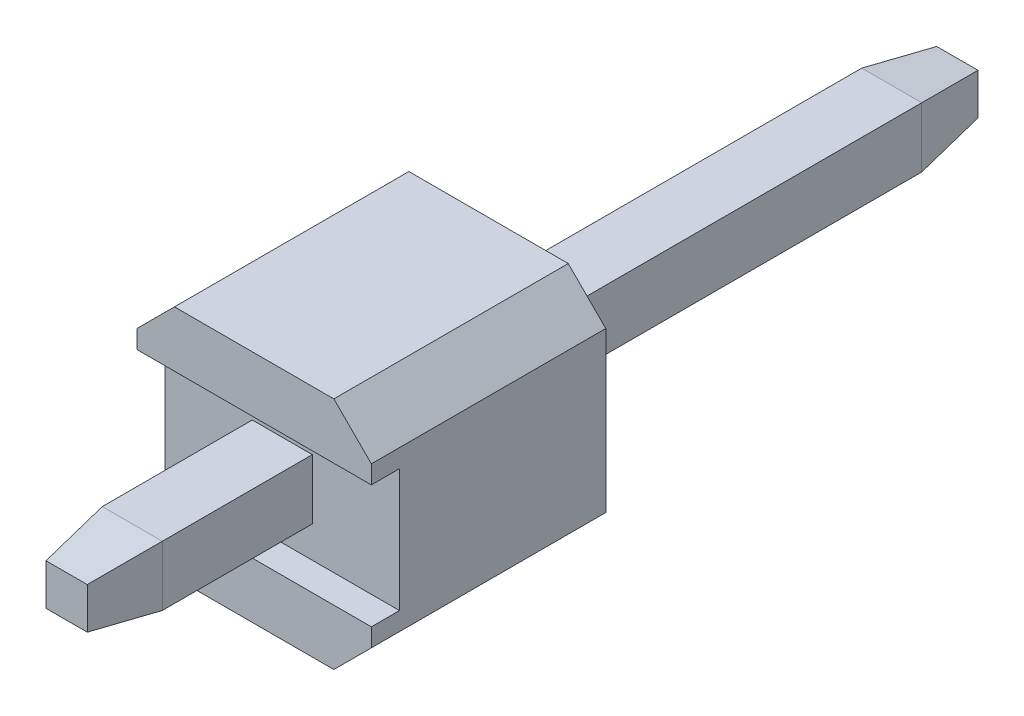
ISO-10303-21;
HEADER;
FILE_DESCRIPTION(('STEP AP214'),'2;1');
FILE_NAME('part.step','',(''),(''),'','','');
FILE_SCHEMA(('AUTOMOTIVE_DESIGN { 1 0 10303 214 1 1 1 1 }'));
ENDSEC;
DATA;
#1=APPLICATION_CONTEXT('core data for automotive mechanical design processes');
#2=APPLICATION_PROTOCOL_DEFINITION('international standard','automotive_design',2000,#1);
#3=PRODUCT_CONTEXT('',#1,'mechanical');
#4=PRODUCT('Part','Part','',(#3));
#5=PRODUCT_RELATED_PRODUCT_CATEGORY('part','',(#4));
#6=PRODUCT_DEFINITION_FORMATION('','',#4);
#7=PRODUCT_DEFINITION_CONTEXT('part definition',#1,'design');
#8=PRODUCT_DEFINITION('design','',#6,#7);
#9=PRODUCT_DEFINITION_SHAPE('','',#8);
#10=(LENGTH_UNIT() NAMED_UNIT(*) SI_UNIT(.MILLI.,.METRE.));
#11=(NAMED_UNIT(*) PLANE_ANGLE_UNIT() SI_UNIT($,.RADIAN.));
#12=(NAMED_UNIT(*) SI_UNIT($,.STERADIAN.) SOLID_ANGLE_UNIT());
#13=UNCERTAINTY_MEASURE_WITH_UNIT(LENGTH_MEASURE(1.E-05),#10,'distance_accuracy_value','');
#14=(GEOMETRIC_REPRESENTATION_CONTEXT(3) GLOBAL_UNCERTAINTY_ASSIGNED_CONTEXT((#13)) GLOBAL_UNIT_ASSIGNED_CONTEXT((#10,
#11,#12)) REPRESENTATION_CONTEXT('',''));
#15=CARTESIAN_POINT('',(0.,0.,0.));
#16=DIRECTION('',(0.,0.,1.));
#17=DIRECTION('',(1.,0.,0.));
#18=AXIS2_PLACEMENT_3D('',#15,#16,#17);
#19=CARTESIAN_POINT('',(-0.16,-0.27,-4.65));
#20=DIRECTION('',(0.,-0.989949493661167,-0.14142135623731));
#21=DIRECTION('',(0.,0.14142135623731,-0.989949493661167));
#22=AXIS2_PLACEMENT_3D('',#19,#20,#21);
#23=PLANE('',#22);
#24=DIRECTION('',(1.,0.,0.));
#25=VECTOR('',#24,1.);
#26=CARTESIAN_POINT('',(-0.16,-0.22,-5.));
#27=LINE('',#26,#25);
#28=CARTESIAN_POINT('',(-0.22,-0.22,-5.));
#29=VERTEX_POINT('',#28);
#30=CARTESIAN_POINT('',(0.22,-0.22,-5.));
#31=VERTEX_POINT('',#30);
#32=EDGE_CURVE('P0_E11',#29,#31,#27,.T.);
#33=ORIENTED_EDGE('',*,*,#32,.T.);
#34=DIRECTION('',(0.140028008402801,-0.140028008402801,0.980196058819607));
#35=VECTOR('',#34,1.);
#36=CARTESIAN_POINT('',(0.22,-0.22,-5.));
#37=LINE('',#36,#35);
#38=CARTESIAN_POINT('',(0.32,-0.32,-4.3));
#39=VERTEX_POINT('',#38);
#40=EDGE_CURVE('P0_E28',#31,#39,#37,.T.);
#41=ORIENTED_EDGE('',*,*,#40,.T.);
#42=DIRECTION('',(-1.,0.,0.));
#43=VECTOR('',#42,1.);
#44=CARTESIAN_POINT('',(-0.16,-0.32,-4.3));
#45=LINE('',#44,#43);
#46=CARTESIAN_POINT('',(-0.32,-0.32,-4.3));
#47=VERTEX_POINT('',#46);
#48=EDGE_CURVE('P0_E104',#39,#47,#45,.T.);
#49=ORIENTED_EDGE('',*,*,#48,.T.);
#50=DIRECTION('',(-0.140028008402801,-0.140028008402801,0.980196058819607));
#51=VECTOR('',#50,1.);
#52=CARTESIAN_POINT('',(-0.22,-0.22,-5.));
#53=LINE('',#52,#51);
#54=EDGE_CURVE('P0_E76',#29,#47,#53,.T.);
#55=ORIENTED_EDGE('',*,*,#54,.F.);
#56=EDGE_LOOP('',(#33,#41,#49,#55));
#57=FACE_BOUND('',#56,.T.);
#58=ADVANCED_FACE('P0_F17',(#57),#23,.T.);
#59=CARTESIAN_POINT('',(0.27,-0.16,-4.65));
#60=DIRECTION('',(0.989949493661167,0.,-0.14142135623731));
#61=DIRECTION('',(0.,-1.,0.));
#62=AXIS2_PLACEMENT_3D('',#59,#60,#61);
#63=PLANE('',#62);
#64=DIRECTION('',(0.,1.,0.));
#65=VECTOR('',#64,1.);
#66=CARTESIAN_POINT('',(0.22,-0.16,-5.));
#67=LINE('',#66,#65);
#68=CARTESIAN_POINT('',(0.22,0.22,-5.));
#69=VERTEX_POINT('',#68);
#70=EDGE_CURVE('P0_E109',#31,#69,#67,.T.);
#71=ORIENTED_EDGE('',*,*,#70,.T.);
#72=DIRECTION('',(0.140028008402801,0.140028008402801,0.980196058819607));
#73=VECTOR('',#72,1.);
#74=CARTESIAN_POINT('',(0.22,0.22,-5.));
#75=LINE('',#74,#73);
#76=CARTESIAN_POINT('',(0.32,0.32,-4.3));
#77=VERTEX_POINT('',#76);
#78=EDGE_CURVE('P0_E21',#69,#77,#75,.T.);
#79=ORIENTED_EDGE('',*,*,#78,.T.);
#80=DIRECTION('',(0.,-1.,0.));
#81=VECTOR('',#80,1.);
#82=CARTESIAN_POINT('',(0.32,-0.16,-4.3));
#83=LINE('',#82,#81);
#84=EDGE_CURVE('P0_E151',#77,#39,#83,.T.);
#85=ORIENTED_EDGE('',*,*,#84,.T.);
#86=ORIENTED_EDGE('',*,*,#40,.F.);
#87=EDGE_LOOP('',(#71,#79,#85,#86));
#88=FACE_BOUND('',#87,.T.);
#89=ADVANCED_FACE('P0_F174',(#88),#63,.T.);
#90=CARTESIAN_POINT('',(0.16,0.27,-4.65));
#91=DIRECTION('',(0.,0.989949493661167,-0.14142135623731));
#92=DIRECTION('',(-1.,0.,0.));
#93=AXIS2_PLACEMENT_3D('',#90,#91,#92);
#94=PLANE('',#93);
#95=DIRECTION('',(-1.,0.,0.));
#96=VECTOR('',#95,1.);
#97=CARTESIAN_POINT('',(0.16,0.22,-5.));
#98=LINE('',#97,#96);
#99=CARTESIAN_POINT('',(-0.22,0.22,-5.));
#100=VERTEX_POINT('',#99);
#101=EDGE_CURVE('P0_E147',#69,#100,#98,.T.);
#102=ORIENTED_EDGE('',*,*,#101,.T.);
#103=DIRECTION('',(-0.140028008402801,0.140028008402801,0.980196058819607));
#104=VECTOR('',#103,1.);
#105=CARTESIAN_POINT('',(-0.22,0.22,-5.));
#106=LINE('',#105,#104);
#107=CARTESIAN_POINT('',(-0.32,0.32,-4.3));
#108=VERTEX_POINT('',#107);
#109=EDGE_CURVE('P0_E152',#100,#108,#106,.T.);
#110=ORIENTED_EDGE('',*,*,#109,.T.);
#111=DIRECTION('',(1.,0.,0.));
#112=VECTOR('',#111,1.);
#113=CARTESIAN_POINT('',(0.16,0.32,-4.3));
#114=LINE('',#113,#112);
#115=EDGE_CURVE('P0_E101',#108,#77,#114,.T.);
#116=ORIENTED_EDGE('',*,*,#115,.T.);
#117=ORIENTED_EDGE('',*,*,#78,.F.);
#118=EDGE_LOOP('',(#102,#110,#116,#117));
#119=FACE_BOUND('',#118,.T.);
#120=ADVANCED_FACE('P0_F167',(#119),#94,.T.);
#121=CARTESIAN_POINT('',(-0.27,0.16,-4.65));
#122=DIRECTION('',(-0.989949493661167,0.,-0.14142135623731));
#123=DIRECTION('',(-0.14142135623731,0.,0.989949493661167));
#124=AXIS2_PLACEMENT_3D('',#121,#122,#123);
#125=PLANE('',#124);
#126=DIRECTION('',(0.,1.,0.));
#127=VECTOR('',#126,1.);
#128=CARTESIAN_POINT('',(-0.32,0.16,-4.3));
#129=LINE('',#128,#127);
#130=EDGE_CURVE('P0_E86',#47,#108,#129,.T.);
#131=ORIENTED_EDGE('',*,*,#130,.T.);
#132=ORIENTED_EDGE('',*,*,#109,.F.);
#133=DIRECTION('',(0.,-1.,0.));
#134=VECTOR('',#133,1.);
#135=CARTESIAN_POINT('',(-0.22,0.16,-5.));
#136=LINE('',#135,#134);
#137=EDGE_CURVE('P0_E89',#100,#29,#136,.T.);
#138=ORIENTED_EDGE('',*,*,#137,.T.);
#139=ORIENTED_EDGE('',*,*,#54,.T.);
#140=EDGE_LOOP('',(#131,#132,#138,#139));
#141=FACE_BOUND('',#140,.T.);
#142=ADVANCED_FACE('P0_F84',(#141),#125,.T.);
#143=CARTESIAN_POINT('',(-0.32,0.32,0.));
#144=DIRECTION('',(-1.,0.,0.));
#145=DIRECTION('',(0.,0.,1.));
#146=AXIS2_PLACEMENT_3D('',#143,#144,#145);
#147=PLANE('',#146);
#148=ORIENTED_EDGE('',*,*,#130,.F.);
#149=DIRECTION('',(0.,0.,1.));
#150=VECTOR('',#149,1.);
#151=CARTESIAN_POINT('',(-0.32,-0.32,0.));
#152=LINE('',#151,#150);
#153=CARTESIAN_POINT('',(-0.32,-0.32,2.));
#154=VERTEX_POINT('',#153);
#155=EDGE_CURVE('P0_E91',#47,#154,#152,.T.);
#156=ORIENTED_EDGE('',*,*,#155,.T.);
#157=DIRECTION('',(0.,-1.,0.));
#158=VECTOR('',#157,1.);
#159=CARTESIAN_POINT('',(-0.32,0.16,2.));
#160=LINE('',#159,#158);
#161=CARTESIAN_POINT('',(-0.32,0.32,2.));
#162=VERTEX_POINT('',#161);
#163=EDGE_CURVE('P0_E131',#162,#154,#160,.T.);
#164=ORIENTED_EDGE('',*,*,#163,.F.);
#165=DIRECTION('',(0.,0.,1.));
#166=VECTOR('',#165,1.);
#167=CARTESIAN_POINT('',(-0.32,0.32,0.));
#168=LINE('',#167,#166);
#169=EDGE_CURVE('P0_E99',#108,#162,#168,.T.);
#170=ORIENTED_EDGE('',*,*,#169,.F.);
#171=EDGE_LOOP('',(#148,#156,#164,#170));
#172=FACE_BOUND('',#171,.T.);
#173=ADVANCED_FACE('P0_F19',(#172),#147,.T.);
#174=CARTESIAN_POINT('',(-0.32,-0.32,0.));
#175=DIRECTION('',(0.,-1.,0.));
#176=DIRECTION('',(0.,0.,-1.));
#177=AXIS2_PLACEMENT_3D('',#174,#175,#176);
#178=PLANE('',#177);
#179=ORIENTED_EDGE('',*,*,#48,.F.);
#180=DIRECTION('',(0.,0.,1.));
#181=VECTOR('',#180,1.);
#182=CARTESIAN_POINT('',(0.32,-0.32,0.));
#183=LINE('',#182,#181);
#184=CARTESIAN_POINT('',(0.32,-0.32,2.));
#185=VERTEX_POINT('',#184);
#186=EDGE_CURVE('P0_E115',#39,#185,#183,.T.);
#187=ORIENTED_EDGE('',*,*,#186,.T.);
#188=DIRECTION('',(1.,0.,0.));
#189=VECTOR('',#188,1.);
#190=CARTESIAN_POINT('',(-0.16,-0.32,2.));
#191=LINE('',#190,#189);
#192=EDGE_CURVE('P0_E113',#154,#185,#191,.T.);
#193=ORIENTED_EDGE('',*,*,#192,.F.);
#194=ORIENTED_EDGE('',*,*,#155,.F.);
#195=EDGE_LOOP('',(#179,#187,#193,#194));
#196=FACE_BOUND('',#195,.T.);
#197=ADVANCED_FACE('P0_F111',(#196),#178,.T.);
#198=CARTESIAN_POINT('',(0.,0.,-5.));
#199=DIRECTION('',(0.,0.,-1.));
#200=DIRECTION('',(0.,-1.,0.));
#201=AXIS2_PLACEMENT_3D('',#198,#199,#200);
#202=PLANE('',#201);
#203=ORIENTED_EDGE('',*,*,#32,.F.);
#204=ORIENTED_EDGE('',*,*,#137,.F.);
#205=ORIENTED_EDGE('',*,*,#101,.F.);
#206=ORIENTED_EDGE('',*,*,#70,.F.);
#207=EDGE_LOOP('',(#203,#204,#205,#206));
#208=FACE_BOUND('',#207,.T.);
#209=ADVANCED_FACE('P0_F233',(#208),#202,.T.);
#210=CARTESIAN_POINT('',(0.32,-0.32,0.));
#211=DIRECTION('',(1.,0.,0.));
#212=DIRECTION('',(0.,1.,0.));
#213=AXIS2_PLACEMENT_3D('',#210,#211,#212);
#214=PLANE('',#213);
#215=ORIENTED_EDGE('',*,*,#84,.F.);
#216=DIRECTION('',(0.,0.,-1.));
#217=VECTOR('',#216,1.);
#218=CARTESIAN_POINT('',(0.32,0.32,0.));
#219=LINE('',#218,#217);
#220=CARTESIAN_POINT('',(0.32,0.32,2.));
#221=VERTEX_POINT('',#220);
#222=EDGE_CURVE('P0_E130',#221,#77,#219,.T.);
#223=ORIENTED_EDGE('',*,*,#222,.F.);
#224=DIRECTION('',(0.,1.,0.));
#225=VECTOR('',#224,1.);
#226=CARTESIAN_POINT('',(0.32,-0.16,2.));
#227=LINE('',#226,#225);
#228=EDGE_CURVE('P0_E125',#185,#221,#227,.T.);
#229=ORIENTED_EDGE('',*,*,#228,.F.);
#230=ORIENTED_EDGE('',*,*,#186,.F.);
#231=EDGE_LOOP('',(#215,#223,#229,#230));
#232=FACE_BOUND('',#231,.T.);
#233=ADVANCED_FACE('P0_F172',(#232),#214,.T.);
#234=CARTESIAN_POINT('',(0.32,0.32,0.));
#235=DIRECTION('',(0.,1.,0.));
#236=DIRECTION('',(1.,0.,0.));
#237=AXIS2_PLACEMENT_3D('',#234,#235,#236);
#238=PLANE('',#237);
#239=ORIENTED_EDGE('',*,*,#115,.F.);
#240=ORIENTED_EDGE('',*,*,#169,.T.);
#241=DIRECTION('',(-1.,0.,0.));
#242=VECTOR('',#241,1.);
#243=CARTESIAN_POINT('',(0.16,0.32,2.));
#244=LINE('',#243,#242);
#245=EDGE_CURVE('P0_E127',#221,#162,#244,.T.);
#246=ORIENTED_EDGE('',*,*,#245,.F.);
#247=ORIENTED_EDGE('',*,*,#222,.T.);
#248=EDGE_LOOP('',(#239,#240,#246,#247));
#249=FACE_BOUND('',#248,.T.);
#250=ADVANCED_FACE('P0_F178',(#249),#238,.T.);
#251=CARTESIAN_POINT('',(0.,0.,2.));
#252=DIRECTION('',(0.,0.,1.));
#253=DIRECTION('',(1.,0.,0.));
#254=AXIS2_PLACEMENT_3D('',#251,#252,#253);
#255=PLANE('',#254);
#256=ORIENTED_EDGE('',*,*,#245,.T.);
#257=ORIENTED_EDGE('',*,*,#163,.T.);
#258=ORIENTED_EDGE('',*,*,#192,.T.);
#259=ORIENTED_EDGE('',*,*,#228,.T.);
#260=EDGE_LOOP('',(#256,#257,#258,#259));
#261=FACE_BOUND('',#260,.T.);
#262=ADVANCED_FACE('P0_F239',(#261),#255,.T.);
#263=CLOSED_SHELL('',(#58,#89,#120,#142,#173,#197,#209,#233,#250,#262));
#264=MANIFOLD_SOLID_BREP('P0_B1',#263);
#265=CARTESIAN_POINT('',(-1.25,0.655430015301126,2.5));
#266=DIRECTION('',(0.,1.,0.));
#267=DIRECTION('',(1.,0.,0.));
#268=AXIS2_PLACEMENT_3D('',#265,#266,#267);
#269=PLANE('',#268);
#270=DIRECTION('',(1.,0.,0.));
#271=VECTOR('',#270,1.);
#272=CARTESIAN_POINT('',(-0.625,0.655430015301126,2.5));
#273=LINE('',#272,#271);
#274=CARTESIAN_POINT('',(-1.25,0.655430015301126,2.5));
#275=VERTEX_POINT('',#274);
#276=CARTESIAN_POINT('',(1.25,0.655430015301126,2.5));
#277=VERTEX_POINT('',#276);
#278=EDGE_CURVE('P1_E202',#275,#277,#273,.T.);
#279=ORIENTED_EDGE('',*,*,#278,.F.);
#280=DIRECTION('',(0.,0.,1.));
#281=VECTOR('',#280,1.);
#282=CARTESIAN_POINT('',(-1.25,0.655430015301126,1.25));
#283=LINE('',#282,#281);
#284=CARTESIAN_POINT('',(-1.25,0.655430015301126,2.2));
#285=VERTEX_POINT('',#284);
#286=EDGE_CURVE('P1_E40',#285,#275,#283,.T.);
#287=ORIENTED_EDGE('',*,*,#286,.F.);
#288=DIRECTION('',(1.,0.,0.));
#289=VECTOR('',#288,1.);
#290=CARTESIAN_POINT('',(-1.25,0.655430015301126,2.2));
#291=LINE('',#290,#289);
#292=CARTESIAN_POINT('',(1.25,0.655430015301126,2.2));
#293=VERTEX_POINT('',#292);
#294=EDGE_CURVE('P1_E11',#285,#293,#291,.T.);
#295=ORIENTED_EDGE('',*,*,#294,.T.);
#296=DIRECTION('',(0.,0.,-1.));
#297=VECTOR('',#296,1.);
#298=CARTESIAN_POINT('',(1.25,0.655430015301126,1.25));
#299=LINE('',#298,#297);
#300=EDGE_CURVE('P1_E21',#277,#293,#299,.T.);
#301=ORIENTED_EDGE('',*,*,#300,.F.);
#302=EDGE_LOOP('',(#279,#287,#295,#301));
#303=FACE_BOUND('',#302,.T.);
#304=ADVANCED_FACE('P1_F17',(#303),#269,.F.);
#305=CARTESIAN_POINT('',(1.25,-0.655430015301126,2.5));
#306=DIRECTION('',(0.,-1.,0.));
#307=DIRECTION('',(0.,0.,-1.));
#308=AXIS2_PLACEMENT_3D('',#305,#306,#307);
#309=PLANE('',#308);
#310=DIRECTION('',(-1.,0.,0.));
#311=VECTOR('',#310,1.);
#312=CARTESIAN_POINT('',(0.625,-0.655430015301126,2.5));
#313=LINE('',#312,#311);
#314=CARTESIAN_POINT('',(1.25,-0.655430015301126,2.5));
#315=VERTEX_POINT('',#314);
#316=CARTESIAN_POINT('',(-1.25,-0.655430015301126,2.5));
#317=VERTEX_POINT('',#316);
#318=EDGE_CURVE('P1_E207',#315,#317,#313,.T.);
#319=ORIENTED_EDGE('',*,*,#318,.F.);
#320=DIRECTION('',(0.,0.,1.));
#321=VECTOR('',#320,1.);
#322=CARTESIAN_POINT('',(1.25,-0.655430015301126,1.25));
#323=LINE('',#322,#321);
#324=CARTESIAN_POINT('',(1.25,-0.655430015301126,2.2));
#325=VERTEX_POINT('',#324);
#326=EDGE_CURVE('P1_E189',#325,#315,#323,.T.);
#327=ORIENTED_EDGE('',*,*,#326,.F.);
#328=DIRECTION('',(-1.,0.,0.));
#329=VECTOR('',#328,1.);
#330=CARTESIAN_POINT('',(1.25,-0.655430015301126,2.2));
#331=LINE('',#330,#329);
#332=CARTESIAN_POINT('',(-1.25,-0.655430015301126,2.2));
#333=VERTEX_POINT('',#332);
#334=EDGE_CURVE('P1_E28',#325,#333,#331,.T.);
#335=ORIENTED_EDGE('',*,*,#334,.T.);
#336=DIRECTION('',(0.,0.,-1.));
#337=VECTOR('',#336,1.);
#338=CARTESIAN_POINT('',(-1.25,-0.655430015301126,1.25));
#339=LINE('',#338,#337);
#340=EDGE_CURVE('P1_E227',#317,#333,#339,.T.);
#341=ORIENTED_EDGE('',*,*,#340,.F.);
#342=EDGE_LOOP('',(#319,#327,#335,#341));
#343=FACE_BOUND('',#342,.T.);
#344=ADVANCED_FACE('P1_F369',(#343),#309,.F.);
#345=CARTESIAN_POINT('',(0.,0.,2.2));
#346=DIRECTION('',(0.,0.,-1.));
#347=DIRECTION('',(0.,-1.,0.));
#348=AXIS2_PLACEMENT_3D('',#345,#346,#347);
#349=PLANE('',#348);
#350=DIRECTION('',(0.,-1.,0.));
#351=VECTOR('',#350,1.);
#352=CARTESIAN_POINT('',(1.25,-0.625,2.2));
#353=LINE('',#352,#351);
#354=EDGE_CURVE('P1_E193',#293,#325,#353,.T.);
#355=ORIENTED_EDGE('',*,*,#354,.F.);
#356=ORIENTED_EDGE('',*,*,#294,.F.);
#357=DIRECTION('',(0.,1.,0.));
#358=VECTOR('',#357,1.);
#359=CARTESIAN_POINT('',(-1.25,0.625,2.2));
#360=LINE('',#359,#358);
#361=EDGE_CURVE('P1_E224',#333,#285,#360,.T.);
#362=ORIENTED_EDGE('',*,*,#361,.F.);
#363=ORIENTED_EDGE('',*,*,#334,.F.);
#364=EDGE_LOOP('',(#355,#356,#362,#363));
#365=FACE_BOUND('',#364,.T.);
#366=DIRECTION('',(0.,-1.,0.));
#367=VECTOR('',#366,1.);
#368=CARTESIAN_POINT('',(-0.32,-0.16,2.2));
#369=LINE('',#368,#367);
#370=CARTESIAN_POINT('',(-0.32,0.32,2.2));
#371=VERTEX_POINT('',#370);
#372=CARTESIAN_POINT('',(-0.32,-0.32,2.2));
#373=VERTEX_POINT('',#372);
#374=EDGE_CURVE('P1_E214',#371,#373,#369,.T.);
#375=ORIENTED_EDGE('',*,*,#374,.F.);
#376=DIRECTION('',(-1.,0.,0.));
#377=VECTOR('',#376,1.);
#378=CARTESIAN_POINT('',(-0.16,0.32,2.2));
#379=LINE('',#378,#377);
#380=CARTESIAN_POINT('',(0.32,0.32,2.2));
#381=VERTEX_POINT('',#380);
#382=EDGE_CURVE('P1_E160',#381,#371,#379,.T.);
#383=ORIENTED_EDGE('',*,*,#382,.F.);
#384=DIRECTION('',(0.,1.,0.));
#385=VECTOR('',#384,1.);
#386=CARTESIAN_POINT('',(0.32,0.16,2.2));
#387=LINE('',#386,#385);
#388=CARTESIAN_POINT('',(0.32,-0.32,2.2));
#389=VERTEX_POINT('',#388);
#390=EDGE_CURVE('P1_E170',#389,#381,#387,.T.);
#391=ORIENTED_EDGE('',*,*,#390,.F.);
#392=DIRECTION('',(1.,0.,0.));
#393=VECTOR('',#392,1.);
#394=CARTESIAN_POINT('',(0.16,-0.32,2.2));
#395=LINE('',#394,#393);
#396=EDGE_CURVE('P1_E154',#373,#389,#395,.T.);
#397=ORIENTED_EDGE('',*,*,#396,.F.);
#398=EDGE_LOOP('',(#375,#383,#391,#397));
#399=FACE_BOUND('',#398,.T.);
#400=ADVANCED_FACE('P1_F375',(#365,#399),#349,.F.);
#401=CARTESIAN_POINT('',(0.,0.,2.5));
#402=DIRECTION('',(0.,0.,1.));
#403=DIRECTION('',(1.,0.,0.));
#404=AXIS2_PLACEMENT_3D('',#401,#402,#403);
#405=PLANE('',#404);
#406=ORIENTED_EDGE('',*,*,#318,.T.);
#407=DIRECTION('',(0.,-1.,0.));
#408=VECTOR('',#407,1.);
#409=CARTESIAN_POINT('',(-1.25,-1.25,2.5));
#410=LINE('',#409,#408);
#411=CARTESIAN_POINT('',(-1.25,-0.85,2.5));
#412=VERTEX_POINT('',#411);
#413=EDGE_CURVE('P1_E211',#317,#412,#410,.T.);
#414=ORIENTED_EDGE('',*,*,#413,.T.);
#415=DIRECTION('',(-0.707106781186548,0.707106781186548,0.));
#416=VECTOR('',#415,1.);
#417=CARTESIAN_POINT('',(-1.05,-1.05,2.5));
#418=LINE('',#417,#416);
#419=CARTESIAN_POINT('',(-0.85,-1.25,2.5));
#420=VERTEX_POINT('',#419);
#421=EDGE_CURVE('P1_E194',#420,#412,#418,.T.);
#422=ORIENTED_EDGE('',*,*,#421,.F.);
#423=DIRECTION('',(1.,0.,0.));
#424=VECTOR('',#423,1.);
#425=CARTESIAN_POINT('',(1.25,-1.25,2.5));
#426=LINE('',#425,#424);
#427=CARTESIAN_POINT('',(0.85,-1.25,2.5));
#428=VERTEX_POINT('',#427);
#429=EDGE_CURVE('P1_E242',#420,#428,#426,.T.);
#430=ORIENTED_EDGE('',*,*,#429,.T.);
#431=DIRECTION('',(-0.707106781186548,-0.707106781186548,0.));
#432=VECTOR('',#431,1.);
#433=CARTESIAN_POINT('',(1.05,-1.05,2.5));
#434=LINE('',#433,#432);
#435=CARTESIAN_POINT('',(1.25,-0.85,2.5));
#436=VERTEX_POINT('',#435);
#437=EDGE_CURVE('P1_E215',#436,#428,#434,.T.);
#438=ORIENTED_EDGE('',*,*,#437,.F.);
#439=DIRECTION('',(0.,1.,0.));
#440=VECTOR('',#439,1.);
#441=CARTESIAN_POINT('',(1.25,1.25,2.5));
#442=LINE('',#441,#440);
#443=EDGE_CURVE('P1_E238',#436,#315,#442,.T.);
#444=ORIENTED_EDGE('',*,*,#443,.T.);
#445=EDGE_LOOP('',(#406,#414,#422,#430,#438,#444));
#446=FACE_BOUND('',#445,.T.);
#447=ADVANCED_FACE('P1_F387',(#446),#405,.T.);
#448=CARTESIAN_POINT('',(0.,0.,2.5));
#449=DIRECTION('',(0.,0.,1.));
#450=DIRECTION('',(1.,0.,0.));
#451=AXIS2_PLACEMENT_3D('',#448,#449,#450);
#452=PLANE('',#451);
#453=ORIENTED_EDGE('',*,*,#278,.T.);
#454=DIRECTION('',(0.,1.,0.));
#455=VECTOR('',#454,1.);
#456=CARTESIAN_POINT('',(1.25,1.25,2.5));
#457=LINE('',#456,#455);
#458=CARTESIAN_POINT('',(1.25,0.85,2.5));
#459=VERTEX_POINT('',#458);
#460=EDGE_CURVE('P1_E198',#277,#459,#457,.T.);
#461=ORIENTED_EDGE('',*,*,#460,.T.);
#462=DIRECTION('',(0.707106781186548,-0.707106781186548,0.));
#463=VECTOR('',#462,1.);
#464=CARTESIAN_POINT('',(1.05,1.05,2.5));
#465=LINE('',#464,#463);
#466=CARTESIAN_POINT('',(0.85,1.25,2.5));
#467=VERTEX_POINT('',#466);
#468=EDGE_CURVE('P1_E288',#467,#459,#465,.T.);
#469=ORIENTED_EDGE('',*,*,#468,.F.);
#470=DIRECTION('',(-1.,0.,0.));
#471=VECTOR('',#470,1.);
#472=CARTESIAN_POINT('',(-1.25,1.25,2.5));
#473=LINE('',#472,#471);
#474=CARTESIAN_POINT('',(-0.85,1.25,2.5));
#475=VERTEX_POINT('',#474);
#476=EDGE_CURVE('P1_E203',#467,#475,#473,.T.);
#477=ORIENTED_EDGE('',*,*,#476,.T.);
#478=DIRECTION('',(0.707106781186548,0.707106781186548,0.));
#479=VECTOR('',#478,1.);
#480=CARTESIAN_POINT('',(-1.05,1.05,2.5));
#481=LINE('',#480,#479);
#482=CARTESIAN_POINT('',(-1.25,0.85,2.5));
#483=VERTEX_POINT('',#482);
#484=EDGE_CURVE('P1_E284',#483,#475,#481,.T.);
#485=ORIENTED_EDGE('',*,*,#484,.F.);
#486=DIRECTION('',(0.,-1.,0.));
#487=VECTOR('',#486,1.);
#488=CARTESIAN_POINT('',(-1.25,-1.25,2.5));
#489=LINE('',#488,#487);
#490=EDGE_CURVE('P1_E249',#483,#275,#489,.T.);
#491=ORIENTED_EDGE('',*,*,#490,.T.);
#492=EDGE_LOOP('',(#453,#461,#469,#477,#485,#491));
#493=FACE_BOUND('',#492,.T.);
#494=ADVANCED_FACE('P1_F320',(#493),#452,.T.);
#495=CARTESIAN_POINT('',(1.25,-1.25,0.));
#496=DIRECTION('',(1.,0.,0.));
#497=DIRECTION('',(0.,1.,0.));
#498=AXIS2_PLACEMENT_3D('',#495,#496,#497);
#499=PLANE('',#498);
#500=ORIENTED_EDGE('',*,*,#300,.T.);
#501=ORIENTED_EDGE('',*,*,#354,.T.);
#502=ORIENTED_EDGE('',*,*,#326,.T.);
#503=ORIENTED_EDGE('',*,*,#443,.F.);
#504=DIRECTION('',(0.,0.,1.));
#505=VECTOR('',#504,1.);
#506=CARTESIAN_POINT('',(1.25,-0.85,0.));
#507=LINE('',#506,#505);
#508=CARTESIAN_POINT('',(1.25,-0.85,0.));
#509=VERTEX_POINT('',#508);
#510=EDGE_CURVE('P1_E256',#509,#436,#507,.T.);
#511=ORIENTED_EDGE('',*,*,#510,.F.);
#512=DIRECTION('',(0.,-1.,0.));
#513=VECTOR('',#512,1.);
#514=CARTESIAN_POINT('',(1.25,1.25,0.));
#515=LINE('',#514,#513);
#516=CARTESIAN_POINT('',(1.25,0.85,0.));
#517=VERTEX_POINT('',#516);
#518=EDGE_CURVE('P1_E237',#517,#509,#515,.T.);
#519=ORIENTED_EDGE('',*,*,#518,.F.);
#520=DIRECTION('',(0.,0.,-1.));
#521=VECTOR('',#520,1.);
#522=CARTESIAN_POINT('',(1.25,0.85,0.));
#523=LINE('',#522,#521);
#524=EDGE_CURVE('P1_E285',#459,#517,#523,.T.);
#525=ORIENTED_EDGE('',*,*,#524,.F.);
#526=ORIENTED_EDGE('',*,*,#460,.F.);
#527=EDGE_LOOP('',(#500,#501,#502,#503,#511,#519,#525,#526));
#528=FACE_BOUND('',#527,.T.);
#529=ADVANCED_FACE('P1_F323',(#528),#499,.T.);
#530=CARTESIAN_POINT('',(0.32,0.32,0.));
#531=DIRECTION('',(-1.,0.,0.));
#532=DIRECTION('',(0.,0.,1.));
#533=AXIS2_PLACEMENT_3D('',#530,#531,#532);
#534=PLANE('',#533);
#535=ORIENTED_EDGE('',*,*,#390,.T.);
#536=DIRECTION('',(0.,0.,1.));
#537=VECTOR('',#536,1.);
#538=CARTESIAN_POINT('',(0.32,0.32,0.));
#539=LINE('',#538,#537);
#540=CARTESIAN_POINT('',(0.32,0.32,0.));
#541=VERTEX_POINT('',#540);
#542=EDGE_CURVE('P1_E165',#541,#381,#539,.T.);
#543=ORIENTED_EDGE('',*,*,#542,.F.);
#544=DIRECTION('',(0.,-1.,0.));
#545=VECTOR('',#544,1.);
#546=CARTESIAN_POINT('',(0.32,0.32,0.));
#547=LINE('',#546,#545);
#548=CARTESIAN_POINT('',(0.32,-0.32,0.));
#549=VERTEX_POINT('',#548);
#550=EDGE_CURVE('P1_E159',#541,#549,#547,.T.);
#551=ORIENTED_EDGE('',*,*,#550,.T.);
#552=DIRECTION('',(0.,0.,1.));
#553=VECTOR('',#552,1.);
#554=CARTESIAN_POINT('',(0.32,-0.32,0.));
#555=LINE('',#554,#553);
#556=EDGE_CURVE('P1_E147',#549,#389,#555,.T.);
#557=ORIENTED_EDGE('',*,*,#556,.T.);
#558=EDGE_LOOP('',(#535,#543,#551,#557));
#559=FACE_BOUND('',#558,.T.);
#560=ADVANCED_FACE('P1_F163',(#559),#534,.T.);
#561=CARTESIAN_POINT('',(-0.32,0.32,0.));
#562=DIRECTION('',(0.,-1.,0.));
#563=DIRECTION('',(0.,0.,-1.));
#564=AXIS2_PLACEMENT_3D('',#561,#562,#563);
#565=PLANE('',#564);
#566=ORIENTED_EDGE('',*,*,#382,.T.);
#567=DIRECTION('',(0.,0.,1.));
#568=VECTOR('',#567,1.);
#569=CARTESIAN_POINT('',(-0.32,0.32,0.));
#570=LINE('',#569,#568);
#571=CARTESIAN_POINT('',(-0.32,0.32,0.));
#572=VERTEX_POINT('',#571);
#573=EDGE_CURVE('P1_E184',#572,#371,#570,.T.);
#574=ORIENTED_EDGE('',*,*,#573,.F.);
#575=DIRECTION('',(1.,0.,0.));
#576=VECTOR('',#575,1.);
#577=CARTESIAN_POINT('',(-0.32,0.32,0.));
#578=LINE('',#577,#576);
#579=EDGE_CURVE('P1_E260',#572,#541,#578,.T.);
#580=ORIENTED_EDGE('',*,*,#579,.T.);
#581=ORIENTED_EDGE('',*,*,#542,.T.);
#582=EDGE_LOOP('',(#566,#574,#580,#581));
#583=FACE_BOUND('',#582,.T.);
#584=ADVANCED_FACE('P1_F385',(#583),#565,.T.);
#585=CARTESIAN_POINT('',(-1.05,-1.05,0.));
#586=DIRECTION('',(-0.707106781186548,-0.707106781186548,0.));
#587=DIRECTION('',(-0.707106781186548,0.707106781186548,0.));
#588=AXIS2_PLACEMENT_3D('',#585,#586,#587);
#589=PLANE('',#588);
#590=ORIENTED_EDGE('',*,*,#421,.T.);
#591=DIRECTION('',(0.,0.,-1.));
#592=VECTOR('',#591,1.);
#593=CARTESIAN_POINT('',(-1.25,-0.85,0.));
#594=LINE('',#593,#592);
#595=CARTESIAN_POINT('',(-1.25,-0.85,0.));
#596=VERTEX_POINT('',#595);
#597=EDGE_CURVE('P1_E197',#412,#596,#594,.T.);
#598=ORIENTED_EDGE('',*,*,#597,.T.);
#599=DIRECTION('',(0.707106781186548,-0.707106781186548,0.));
#600=VECTOR('',#599,1.);
#601=CARTESIAN_POINT('',(-1.05,-1.05,0.));
#602=LINE('',#601,#600);
#603=CARTESIAN_POINT('',(-0.85,-1.25,0.));
#604=VERTEX_POINT('',#603);
#605=EDGE_CURVE('P1_E277',#596,#604,#602,.T.);
#606=ORIENTED_EDGE('',*,*,#605,.T.);
#607=DIRECTION('',(0.,0.,1.));
#608=VECTOR('',#607,1.);
#609=CARTESIAN_POINT('',(-0.85,-1.25,0.));
#610=LINE('',#609,#608);
#611=EDGE_CURVE('P1_E232',#604,#420,#610,.T.);
#612=ORIENTED_EDGE('',*,*,#611,.T.);
#613=EDGE_LOOP('',(#590,#598,#606,#612));
#614=FACE_BOUND('',#613,.T.);
#615=ADVANCED_FACE('P1_F352',(#614),#589,.T.);
#616=CARTESIAN_POINT('',(-1.25,-1.25,0.));
#617=DIRECTION('',(0.,-1.,0.));
#618=DIRECTION('',(0.,0.,-1.));
#619=AXIS2_PLACEMENT_3D('',#616,#617,#618);
#620=PLANE('',#619);
#621=ORIENTED_EDGE('',*,*,#611,.F.);
#622=DIRECTION('',(-1.,0.,0.));
#623=VECTOR('',#622,1.);
#624=CARTESIAN_POINT('',(1.25,-1.25,0.));
#625=LINE('',#624,#623);
#626=CARTESIAN_POINT('',(0.85,-1.25,0.));
#627=VERTEX_POINT('',#626);
#628=EDGE_CURVE('P1_E272',#627,#604,#625,.T.);
#629=ORIENTED_EDGE('',*,*,#628,.F.);
#630=DIRECTION('',(0.,0.,-1.));
#631=VECTOR('',#630,1.);
#632=CARTESIAN_POINT('',(0.85,-1.25,0.));
#633=LINE('',#632,#631);
#634=EDGE_CURVE('P1_E219',#428,#627,#633,.T.);
#635=ORIENTED_EDGE('',*,*,#634,.F.);
#636=ORIENTED_EDGE('',*,*,#429,.F.);
#637=EDGE_LOOP('',(#621,#629,#635,#636));
#638=FACE_BOUND('',#637,.T.);
#639=ADVANCED_FACE('P1_F365',(#638),#620,.T.);
#640=CARTESIAN_POINT('',(0.,0.,0.));
#641=DIRECTION('',(0.,0.,1.));
#642=DIRECTION('',(1.,0.,0.));
#643=AXIS2_PLACEMENT_3D('',#640,#641,#642);
#644=PLANE('',#643);
#645=ORIENTED_EDGE('',*,*,#605,.F.);
#646=DIRECTION('',(0.,1.,0.));
#647=VECTOR('',#646,1.);
#648=CARTESIAN_POINT('',(-1.25,-1.25,0.));
#649=LINE('',#648,#647);
#650=CARTESIAN_POINT('',(-1.25,0.85,0.));
#651=VERTEX_POINT('',#650);
#652=EDGE_CURVE('P1_E228',#596,#651,#649,.T.);
#653=ORIENTED_EDGE('',*,*,#652,.T.);
#654=DIRECTION('',(-0.707106781186548,-0.707106781186548,0.));
#655=VECTOR('',#654,1.);
#656=CARTESIAN_POINT('',(-1.05,1.05,0.));
#657=LINE('',#656,#655);
#658=CARTESIAN_POINT('',(-0.85,1.25,0.));
#659=VERTEX_POINT('',#658);
#660=EDGE_CURVE('P1_E263',#659,#651,#657,.T.);
#661=ORIENTED_EDGE('',*,*,#660,.F.);
#662=DIRECTION('',(1.,0.,0.));
#663=VECTOR('',#662,1.);
#664=CARTESIAN_POINT('',(-1.25,1.25,0.));
#665=LINE('',#664,#663);
#666=CARTESIAN_POINT('',(0.85,1.25,0.));
#667=VERTEX_POINT('',#666);
#668=EDGE_CURVE('P1_E233',#659,#667,#665,.T.);
#669=ORIENTED_EDGE('',*,*,#668,.T.);
#670=DIRECTION('',(-0.707106781186548,0.707106781186548,0.));
#671=VECTOR('',#670,1.);
#672=CARTESIAN_POINT('',(1.05,1.05,0.));
#673=LINE('',#672,#671);
#674=EDGE_CURVE('P1_E223',#517,#667,#673,.T.);
#675=ORIENTED_EDGE('',*,*,#674,.F.);
#676=ORIENTED_EDGE('',*,*,#518,.T.);
#677=DIRECTION('',(0.707106781186548,0.707106781186548,0.));
#678=VECTOR('',#677,1.);
#679=CARTESIAN_POINT('',(1.05,-1.05,0.));
#680=LINE('',#679,#678);
#681=EDGE_CURVE('P1_E245',#627,#509,#680,.T.);
#682=ORIENTED_EDGE('',*,*,#681,.F.);
#683=ORIENTED_EDGE('',*,*,#628,.T.);
#684=EDGE_LOOP('',(#645,#653,#661,#669,#675,#676,#682,#683));
#685=FACE_BOUND('',#684,.T.);
#686=ORIENTED_EDGE('',*,*,#579,.F.);
#687=DIRECTION('',(0.,1.,0.));
#688=VECTOR('',#687,1.);
#689=CARTESIAN_POINT('',(-0.32,-0.32,0.));
#690=LINE('',#689,#688);
#691=CARTESIAN_POINT('',(-0.32,-0.32,0.));
#692=VERTEX_POINT('',#691);
#693=EDGE_CURVE('P1_E174',#692,#572,#690,.T.);
#694=ORIENTED_EDGE('',*,*,#693,.F.);
#695=DIRECTION('',(-1.,0.,0.));
#696=VECTOR('',#695,1.);
#697=CARTESIAN_POINT('',(0.32,-0.32,0.));
#698=LINE('',#697,#696);
#699=EDGE_CURVE('P1_E152',#549,#692,#698,.T.);
#700=ORIENTED_EDGE('',*,*,#699,.F.);
#701=ORIENTED_EDGE('',*,*,#550,.F.);
#702=EDGE_LOOP('',(#686,#694,#700,#701));
#703=FACE_BOUND('',#702,.T.);
#704=ADVANCED_FACE('P1_F172',(#685,#703),#644,.F.);
#705=CARTESIAN_POINT('',(-1.05,1.05,0.));
#706=DIRECTION('',(-0.707106781186548,0.707106781186548,0.));
#707=DIRECTION('',(0.,0.,1.));
#708=AXIS2_PLACEMENT_3D('',#705,#706,#707);
#709=PLANE('',#708);
#710=ORIENTED_EDGE('',*,*,#484,.T.);
#711=DIRECTION('',(0.,0.,-1.));
#712=VECTOR('',#711,1.);
#713=CARTESIAN_POINT('',(-0.85,1.25,0.));
#714=LINE('',#713,#712);
#715=EDGE_CURVE('P1_E266',#475,#659,#714,.T.);
#716=ORIENTED_EDGE('',*,*,#715,.T.);
#717=ORIENTED_EDGE('',*,*,#660,.T.);
#718=DIRECTION('',(0.,0.,1.));
#719=VECTOR('',#718,1.);
#720=CARTESIAN_POINT('',(-1.25,0.85,0.));
#721=LINE('',#720,#719);
#722=EDGE_CURVE('P1_E267',#651,#483,#721,.T.);
#723=ORIENTED_EDGE('',*,*,#722,.T.);
#724=EDGE_LOOP('',(#710,#716,#717,#723));
#725=FACE_BOUND('',#724,.T.);
#726=ADVANCED_FACE('P1_F356',(#725),#709,.T.);
#727=CARTESIAN_POINT('',(1.25,1.25,0.));
#728=DIRECTION('',(0.,1.,0.));
#729=DIRECTION('',(1.,0.,0.));
#730=AXIS2_PLACEMENT_3D('',#727,#728,#729);
#731=PLANE('',#730);
#732=ORIENTED_EDGE('',*,*,#715,.F.);
#733=ORIENTED_EDGE('',*,*,#476,.F.);
#734=DIRECTION('',(0.,0.,1.));
#735=VECTOR('',#734,1.);
#736=CARTESIAN_POINT('',(0.85,1.25,0.));
#737=LINE('',#736,#735);
#738=EDGE_CURVE('P1_E218',#667,#467,#737,.T.);
#739=ORIENTED_EDGE('',*,*,#738,.F.);
#740=ORIENTED_EDGE('',*,*,#668,.F.);
#741=EDGE_LOOP('',(#732,#733,#739,#740));
#742=FACE_BOUND('',#741,.T.);
#743=ADVANCED_FACE('P1_F333',(#742),#731,.T.);
#744=CARTESIAN_POINT('',(1.05,1.05,0.));
#745=DIRECTION('',(0.707106781186548,0.707106781186548,0.));
#746=DIRECTION('',(0.,0.,-1.));
#747=AXIS2_PLACEMENT_3D('',#744,#745,#746);
#748=PLANE('',#747);
#749=ORIENTED_EDGE('',*,*,#468,.T.);
#750=ORIENTED_EDGE('',*,*,#524,.T.);
#751=ORIENTED_EDGE('',*,*,#674,.T.);
#752=ORIENTED_EDGE('',*,*,#738,.T.);
#753=EDGE_LOOP('',(#749,#750,#751,#752));
#754=FACE_BOUND('',#753,.T.);
#755=ADVANCED_FACE('P1_F313',(#754),#748,.T.);
#756=CARTESIAN_POINT('',(1.05,-1.05,0.));
#757=DIRECTION('',(0.707106781186548,-0.707106781186548,0.));
#758=DIRECTION('',(0.,0.,-1.));
#759=AXIS2_PLACEMENT_3D('',#756,#757,#758);
#760=PLANE('',#759);
#761=ORIENTED_EDGE('',*,*,#437,.T.);
#762=ORIENTED_EDGE('',*,*,#634,.T.);
#763=ORIENTED_EDGE('',*,*,#681,.T.);
#764=ORIENTED_EDGE('',*,*,#510,.T.);
#765=EDGE_LOOP('',(#761,#762,#763,#764));
#766=FACE_BOUND('',#765,.T.);
#767=ADVANCED_FACE('P1_F19',(#766),#760,.T.);
#768=CARTESIAN_POINT('',(-0.32,-0.32,0.));
#769=DIRECTION('',(1.,0.,0.));
#770=DIRECTION('',(0.,1.,0.));
#771=AXIS2_PLACEMENT_3D('',#768,#769,#770);
#772=PLANE('',#771);
#773=ORIENTED_EDGE('',*,*,#374,.T.);
#774=DIRECTION('',(0.,0.,1.));
#775=VECTOR('',#774,1.);
#776=CARTESIAN_POINT('',(-0.32,-0.32,0.));
#777=LINE('',#776,#775);
#778=EDGE_CURVE('P1_E177',#692,#373,#777,.T.);
#779=ORIENTED_EDGE('',*,*,#778,.F.);
#780=ORIENTED_EDGE('',*,*,#693,.T.);
#781=ORIENTED_EDGE('',*,*,#573,.T.);
#782=EDGE_LOOP('',(#773,#779,#780,#781));
#783=FACE_BOUND('',#782,.T.);
#784=ADVANCED_FACE('P1_F380',(#783),#772,.T.);
#785=CARTESIAN_POINT('',(0.32,-0.32,0.));
#786=DIRECTION('',(0.,1.,0.));
#787=DIRECTION('',(1.,0.,0.));
#788=AXIS2_PLACEMENT_3D('',#785,#786,#787);
#789=PLANE('',#788);
#790=ORIENTED_EDGE('',*,*,#396,.T.);
#791=ORIENTED_EDGE('',*,*,#556,.F.);
#792=ORIENTED_EDGE('',*,*,#699,.T.);
#793=ORIENTED_EDGE('',*,*,#778,.T.);
#794=EDGE_LOOP('',(#790,#791,#792,#793));
#795=FACE_BOUND('',#794,.T.);
#796=ADVANCED_FACE('P1_F149',(#795),#789,.T.);
#797=CARTESIAN_POINT('',(-1.25,1.25,0.));
#798=DIRECTION('',(-1.,0.,0.));
#799=DIRECTION('',(0.,0.,1.));
#800=AXIS2_PLACEMENT_3D('',#797,#798,#799);
#801=PLANE('',#800);
#802=ORIENTED_EDGE('',*,*,#286,.T.);
#803=ORIENTED_EDGE('',*,*,#490,.F.);
#804=ORIENTED_EDGE('',*,*,#722,.F.);
#805=ORIENTED_EDGE('',*,*,#652,.F.);
#806=ORIENTED_EDGE('',*,*,#597,.F.);
#807=ORIENTED_EDGE('',*,*,#413,.F.);
#808=ORIENTED_EDGE('',*,*,#340,.T.);
#809=ORIENTED_EDGE('',*,*,#361,.T.);
#810=EDGE_LOOP('',(#802,#803,#804,#805,#806,#807,#808,#809));
#811=FACE_BOUND('',#810,.T.);
#812=ADVANCED_FACE('P1_F355',(#811),#801,.T.);
#813=CLOSED_SHELL('',(#304,#344,#400,#447,#494,#529,#560,#584,#615,#639,#704,#726,#743,#755,
#767,#784,#796,#812));
#814=MANIFOLD_SOLID_BREP('P1_B1',#813);
#815=CARTESIAN_POINT('',(0.27,-0.16,4.15));
#816=DIRECTION('',(0.989949493661167,0.,0.141421356237309));
#817=DIRECTION('',(0.,-1.,0.));
#818=AXIS2_PLACEMENT_3D('',#815,#816,#817);
#819=PLANE('',#818);
#820=DIRECTION('',(0.,-1.,0.));
#821=VECTOR('',#820,1.);
#822=CARTESIAN_POINT('',(0.22,-0.16,4.5));
#823=LINE('',#822,#821);
#824=CARTESIAN_POINT('',(0.22,0.22,4.5));
#825=VERTEX_POINT('',#824);
#826=CARTESIAN_POINT('',(0.22,-0.22,4.5));
#827=VERTEX_POINT('',#826);
#828=EDGE_CURVE('P2_E11',#825,#827,#823,.T.);
#829=ORIENTED_EDGE('',*,*,#828,.T.);
#830=DIRECTION('',(0.140028008402801,-0.140028008402801,-0.980196058819607));
#831=VECTOR('',#830,1.);
#832=CARTESIAN_POINT('',(0.22,-0.22,4.5));
#833=LINE('',#832,#831);
#834=CARTESIAN_POINT('',(0.32,-0.32,3.8));
#835=VERTEX_POINT('',#834);
#836=EDGE_CURVE('P2_E28',#827,#835,#833,.T.);
#837=ORIENTED_EDGE('',*,*,#836,.T.);
#838=DIRECTION('',(0.,1.,0.));
#839=VECTOR('',#838,1.);
#840=CARTESIAN_POINT('',(0.32,-0.16,3.8));
#841=LINE('',#840,#839);
#842=CARTESIAN_POINT('',(0.32,0.32,3.8));
#843=VERTEX_POINT('',#842);
#844=EDGE_CURVE('P2_E142',#835,#843,#841,.T.);
#845=ORIENTED_EDGE('',*,*,#844,.T.);
#846=DIRECTION('',(0.140028008402801,0.140028008402801,-0.980196058819607));
#847=VECTOR('',#846,1.);
#848=CARTESIAN_POINT('',(0.22,0.22,4.5));
#849=LINE('',#848,#847);
#850=EDGE_CURVE('P2_E71',#825,#843,#849,.T.);
#851=ORIENTED_EDGE('',*,*,#850,.F.);
#852=EDGE_LOOP('',(#829,#837,#845,#851));
#853=FACE_BOUND('',#852,.T.);
#854=ADVANCED_FACE('P2_F17',(#853),#819,.T.);
#855=CARTESIAN_POINT('',(-0.16,-0.27,4.15));
#856=DIRECTION('',(0.,-0.989949493661167,0.141421356237309));
#857=DIRECTION('',(-1.,0.,0.));
#858=AXIS2_PLACEMENT_3D('',#855,#856,#857);
#859=PLANE('',#858);
#860=DIRECTION('',(-1.,0.,0.));
#861=VECTOR('',#860,1.);
#862=CARTESIAN_POINT('',(-0.16,-0.22,4.5));
#863=LINE('',#862,#861);
#864=CARTESIAN_POINT('',(-0.22,-0.22,4.5));
#865=VERTEX_POINT('',#864);
#866=EDGE_CURVE('P2_E140',#827,#865,#863,.T.);
#867=ORIENTED_EDGE('',*,*,#866,.T.);
#868=DIRECTION('',(-0.140028008402801,-0.140028008402801,-0.980196058819607));
#869=VECTOR('',#868,1.);
#870=CARTESIAN_POINT('',(-0.22,-0.22,4.5));
#871=LINE('',#870,#869);
#872=CARTESIAN_POINT('',(-0.32,-0.32,3.8));
#873=VERTEX_POINT('',#872);
#874=EDGE_CURVE('P2_E87',#865,#873,#871,.T.);
#875=ORIENTED_EDGE('',*,*,#874,.T.);
#876=DIRECTION('',(1.,0.,0.));
#877=VECTOR('',#876,1.);
#878=CARTESIAN_POINT('',(-0.16,-0.32,3.8));
#879=LINE('',#878,#877);
#880=EDGE_CURVE('P2_E147',#873,#835,#879,.T.);
#881=ORIENTED_EDGE('',*,*,#880,.T.);
#882=ORIENTED_EDGE('',*,*,#836,.F.);
#883=EDGE_LOOP('',(#867,#875,#881,#882));
#884=FACE_BOUND('',#883,.T.);
#885=ADVANCED_FACE('P2_F255',(#884),#859,.T.);
#886=CARTESIAN_POINT('',(-0.27,0.16,4.15));
#887=DIRECTION('',(-0.989949493661167,0.,0.141421356237309));
#888=DIRECTION('',(0.,1.,0.));
#889=AXIS2_PLACEMENT_3D('',#886,#887,#888);
#890=PLANE('',#889);
#891=DIRECTION('',(0.,1.,0.));
#892=VECTOR('',#891,1.);
#893=CARTESIAN_POINT('',(-0.22,0.16,4.5));
#894=LINE('',#893,#892);
#895=CARTESIAN_POINT('',(-0.22,0.22,4.5));
#896=VERTEX_POINT('',#895);
#897=EDGE_CURVE('P2_E21',#865,#896,#894,.T.);
#898=ORIENTED_EDGE('',*,*,#897,.T.);
#899=DIRECTION('',(-0.140028008402801,0.140028008402801,-0.980196058819607));
#900=VECTOR('',#899,1.);
#901=CARTESIAN_POINT('',(-0.22,0.22,4.5));
#902=LINE('',#901,#900);
#903=CARTESIAN_POINT('',(-0.32,0.32,3.8));
#904=VERTEX_POINT('',#903);
#905=EDGE_CURVE('P2_E151',#896,#904,#902,.T.);
#906=ORIENTED_EDGE('',*,*,#905,.T.);
#907=DIRECTION('',(0.,-1.,0.));
#908=VECTOR('',#907,1.);
#909=CARTESIAN_POINT('',(-0.32,0.16,3.8));
#910=LINE('',#909,#908);
#911=EDGE_CURVE('P2_E111',#904,#873,#910,.T.);
#912=ORIENTED_EDGE('',*,*,#911,.T.);
#913=ORIENTED_EDGE('',*,*,#874,.F.);
#914=EDGE_LOOP('',(#898,#906,#912,#913));
#915=FACE_BOUND('',#914,.T.);
#916=ADVANCED_FACE('P2_F250',(#915),#890,.T.);
#917=CARTESIAN_POINT('',(0.16,0.27,4.15));
#918=DIRECTION('',(0.,0.989949493661167,0.141421356237309));
#919=DIRECTION('',(1.,0.,0.));
#920=AXIS2_PLACEMENT_3D('',#917,#918,#919);
#921=PLANE('',#920);
#922=DIRECTION('',(-1.,0.,0.));
#923=VECTOR('',#922,1.);
#924=CARTESIAN_POINT('',(0.16,0.32,3.8));
#925=LINE('',#924,#923);
#926=EDGE_CURVE('P2_E152',#843,#904,#925,.T.);
#927=ORIENTED_EDGE('',*,*,#926,.T.);
#928=ORIENTED_EDGE('',*,*,#905,.F.);
#929=DIRECTION('',(1.,0.,0.));
#930=VECTOR('',#929,1.);
#931=CARTESIAN_POINT('',(0.16,0.22,4.5));
#932=LINE('',#931,#930);
#933=EDGE_CURVE('P2_E158',#896,#825,#932,.T.);
#934=ORIENTED_EDGE('',*,*,#933,.T.);
#935=ORIENTED_EDGE('',*,*,#850,.T.);
#936=EDGE_LOOP('',(#927,#928,#934,#935));
#937=FACE_BOUND('',#936,.T.);
#938=ADVANCED_FACE('P2_F245',(#937),#921,.T.);
#939=CARTESIAN_POINT('',(0.32,0.32,2.));
#940=DIRECTION('',(0.,1.,0.));
#941=DIRECTION('',(1.,0.,0.));
#942=AXIS2_PLACEMENT_3D('',#939,#940,#941);
#943=PLANE('',#942);
#944=ORIENTED_EDGE('',*,*,#926,.F.);
#945=DIRECTION('',(0.,0.,1.));
#946=VECTOR('',#945,1.);
#947=CARTESIAN_POINT('',(0.32,0.32,2.));
#948=LINE('',#947,#946);
#949=CARTESIAN_POINT('',(0.32,0.32,2.));
#950=VERTEX_POINT('',#949);
#951=EDGE_CURVE('P2_E121',#950,#843,#948,.T.);
#952=ORIENTED_EDGE('',*,*,#951,.F.);
#953=DIRECTION('',(-1.,0.,0.));
#954=VECTOR('',#953,1.);
#955=CARTESIAN_POINT('',(0.16,0.32,2.));
#956=LINE('',#955,#954);
#957=CARTESIAN_POINT('',(-0.32,0.32,2.));
#958=VERTEX_POINT('',#957);
#959=EDGE_CURVE('P2_E115',#950,#958,#956,.T.);
#960=ORIENTED_EDGE('',*,*,#959,.T.);
#961=DIRECTION('',(0.,0.,1.));
#962=VECTOR('',#961,1.);
#963=CARTESIAN_POINT('',(-0.32,0.32,2.));
#964=LINE('',#963,#962);
#965=EDGE_CURVE('P2_E105',#958,#904,#964,.T.);
#966=ORIENTED_EDGE('',*,*,#965,.T.);
#967=EDGE_LOOP('',(#944,#952,#960,#966));
#968=FACE_BOUND('',#967,.T.);
#969=ADVANCED_FACE('P2_F119',(#968),#943,.T.);
#970=CARTESIAN_POINT('',(0.32,-0.32,2.));
#971=DIRECTION('',(1.,0.,0.));
#972=DIRECTION('',(0.,1.,0.));
#973=AXIS2_PLACEMENT_3D('',#970,#971,#972);
#974=PLANE('',#973);
#975=ORIENTED_EDGE('',*,*,#844,.F.);
#976=DIRECTION('',(0.,0.,1.));
#977=VECTOR('',#976,1.);
#978=CARTESIAN_POINT('',(0.32,-0.32,2.));
#979=LINE('',#978,#977);
#980=CARTESIAN_POINT('',(0.32,-0.32,2.));
#981=VERTEX_POINT('',#980);
#982=EDGE_CURVE('P2_E96',#981,#835,#979,.T.);
#983=ORIENTED_EDGE('',*,*,#982,.F.);
#984=DIRECTION('',(0.,1.,0.));
#985=VECTOR('',#984,1.);
#986=CARTESIAN_POINT('',(0.32,-0.16,2.));
#987=LINE('',#986,#985);
#988=EDGE_CURVE('P2_E116',#981,#950,#987,.T.);
#989=ORIENTED_EDGE('',*,*,#988,.T.);
#990=ORIENTED_EDGE('',*,*,#951,.T.);
#991=EDGE_LOOP('',(#975,#983,#989,#990));
#992=FACE_BOUND('',#991,.T.);
#993=ADVANCED_FACE('P2_F231',(#992),#974,.T.);
#994=CARTESIAN_POINT('',(0.,0.,4.5));
#995=DIRECTION('',(0.,0.,1.));
#996=DIRECTION('',(1.,0.,0.));
#997=AXIS2_PLACEMENT_3D('',#994,#995,#996);
#998=PLANE('',#997);
#999=ORIENTED_EDGE('',*,*,#828,.F.);
#1000=ORIENTED_EDGE('',*,*,#933,.F.);
#1001=ORIENTED_EDGE('',*,*,#897,.F.);
#1002=ORIENTED_EDGE('',*,*,#866,.F.);
#1003=EDGE_LOOP('',(#999,#1000,#1001,#1002));
#1004=FACE_BOUND('',#1003,.T.);
#1005=ADVANCED_FACE('P2_F236',(#1004),#998,.T.);
#1006=CARTESIAN_POINT('',(-0.32,-0.32,2.));
#1007=DIRECTION('',(0.,-1.,0.));
#1008=DIRECTION('',(0.,0.,-1.));
#1009=AXIS2_PLACEMENT_3D('',#1006,#1007,#1008);
#1010=PLANE('',#1009);
#1011=ORIENTED_EDGE('',*,*,#880,.F.);
#1012=DIRECTION('',(0.,0.,1.));
#1013=VECTOR('',#1012,1.);
#1014=CARTESIAN_POINT('',(-0.32,-0.32,2.));
#1015=LINE('',#1014,#1013);
#1016=CARTESIAN_POINT('',(-0.32,-0.32,2.));
#1017=VERTEX_POINT('',#1016);
#1018=EDGE_CURVE('P2_E129',#1017,#873,#1015,.T.);
#1019=ORIENTED_EDGE('',*,*,#1018,.F.);
#1020=DIRECTION('',(1.,0.,0.));
#1021=VECTOR('',#1020,1.);
#1022=CARTESIAN_POINT('',(-0.16,-0.32,2.));
#1023=LINE('',#1022,#1021);
#1024=EDGE_CURVE('P2_E127',#1017,#981,#1023,.T.);
#1025=ORIENTED_EDGE('',*,*,#1024,.T.);
#1026=ORIENTED_EDGE('',*,*,#982,.T.);
#1027=EDGE_LOOP('',(#1011,#1019,#1025,#1026));
#1028=FACE_BOUND('',#1027,.T.);
#1029=ADVANCED_FACE('P2_F282',(#1028),#1010,.T.);
#1030=CARTESIAN_POINT('',(-0.32,0.32,2.));
#1031=DIRECTION('',(-1.,0.,0.));
#1032=DIRECTION('',(0.,0.,1.));
#1033=AXIS2_PLACEMENT_3D('',#1030,#1031,#1032);
#1034=PLANE('',#1033);
#1035=ORIENTED_EDGE('',*,*,#911,.F.);
#1036=ORIENTED_EDGE('',*,*,#965,.F.);
#1037=DIRECTION('',(0.,-1.,0.));
#1038=VECTOR('',#1037,1.);
#1039=CARTESIAN_POINT('',(-0.32,0.16,2.));
#1040=LINE('',#1039,#1038);
#1041=EDGE_CURVE('P2_E110',#958,#1017,#1040,.T.);
#1042=ORIENTED_EDGE('',*,*,#1041,.T.);
#1043=ORIENTED_EDGE('',*,*,#1018,.T.);
#1044=EDGE_LOOP('',(#1035,#1036,#1042,#1043));
#1045=FACE_BOUND('',#1044,.T.);
#1046=ADVANCED_FACE('P2_F107',(#1045),#1034,.T.);
#1047=CARTESIAN_POINT('',(0.,0.,2.));
#1048=DIRECTION('',(0.,0.,1.));
#1049=DIRECTION('',(1.,0.,0.));
#1050=AXIS2_PLACEMENT_3D('',#1047,#1048,#1049);
#1051=PLANE('',#1050);
#1052=ORIENTED_EDGE('',*,*,#959,.F.);
#1053=ORIENTED_EDGE('',*,*,#988,.F.);
#1054=ORIENTED_EDGE('',*,*,#1024,.F.);
#1055=ORIENTED_EDGE('',*,*,#1041,.F.);
#1056=EDGE_LOOP('',(#1052,#1053,#1054,#1055));
#1057=FACE_BOUND('',#1056,.T.);
#1058=ADVANCED_FACE('P2_F19',(#1057),#1051,.F.);
#1059=CLOSED_SHELL('',(#854,#885,#916,#938,#969,#993,#1005,#1029,#1046,#1058));
#1060=MANIFOLD_SOLID_BREP('P2_B1',#1059);
#1061=ADVANCED_BREP_SHAPE_REPRESENTATION('',(#18,#264,#814,#1060),#14);
#1062=SHAPE_DEFINITION_REPRESENTATION(#9,#1061);
ENDSEC;
END-ISO-10303-21;
